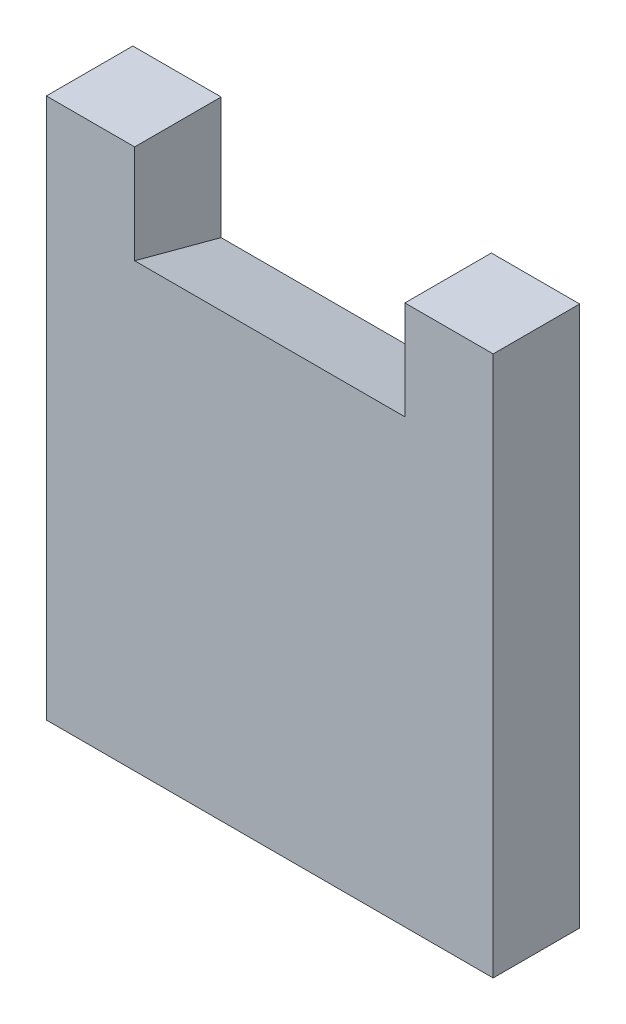
ISO-10303-21;
HEADER;
FILE_DESCRIPTION(('STEP AP214'),'2;1');
FILE_NAME('part.step','',(''),(''),'','','');
FILE_SCHEMA(('AUTOMOTIVE_DESIGN { 1 0 10303 214 1 1 1 1 }'));
ENDSEC;
DATA;
#1=APPLICATION_CONTEXT('core data for automotive mechanical design processes');
#2=APPLICATION_PROTOCOL_DEFINITION('international standard','automotive_design',2000,#1);
#3=PRODUCT_CONTEXT('',#1,'mechanical');
#4=PRODUCT('Part','Part','',(#3));
#5=PRODUCT_RELATED_PRODUCT_CATEGORY('part','',(#4));
#6=PRODUCT_DEFINITION_FORMATION('','',#4);
#7=PRODUCT_DEFINITION_CONTEXT('part definition',#1,'design');
#8=PRODUCT_DEFINITION('design','',#6,#7);
#9=PRODUCT_DEFINITION_SHAPE('','',#8);
#10=(LENGTH_UNIT() NAMED_UNIT(*) SI_UNIT(.MILLI.,.METRE.));
#11=(NAMED_UNIT(*) PLANE_ANGLE_UNIT() SI_UNIT($,.RADIAN.));
#12=(NAMED_UNIT(*) SI_UNIT($,.STERADIAN.) SOLID_ANGLE_UNIT());
#13=UNCERTAINTY_MEASURE_WITH_UNIT(LENGTH_MEASURE(1.E-05),#10,'distance_accuracy_value','');
#14=(GEOMETRIC_REPRESENTATION_CONTEXT(3) GLOBAL_UNCERTAINTY_ASSIGNED_CONTEXT((#13)) GLOBAL_UNIT_ASSIGNED_CONTEXT((#10,
#11,#12)) REPRESENTATION_CONTEXT('',''));
#15=CARTESIAN_POINT('',(0.,0.,0.));
#16=DIRECTION('',(0.,0.,1.));
#17=DIRECTION('',(1.,0.,0.));
#18=AXIS2_PLACEMENT_3D('',#15,#16,#17);
#19=CARTESIAN_POINT('',(0.,0.,9.6));
#20=DIRECTION('',(0.,1.,0.));
#21=DIRECTION('',(0.,0.,1.));
#22=AXIS2_PLACEMENT_3D('',#19,#20,#21);
#23=PLANE('',#22);
#24=DIRECTION('',(1.,0.,0.));
#25=VECTOR('',#24,1.);
#26=CARTESIAN_POINT('',(0.,0.,0.));
#27=LINE('',#26,#25);
#28=CARTESIAN_POINT('',(39.8,0.,0.));
#29=VERTEX_POINT('',#28);
#30=CARTESIAN_POINT('',(49.6,0.,0.));
#31=VERTEX_POINT('',#30);
#32=EDGE_CURVE('E114',#29,#31,#27,.T.);
#33=ORIENTED_EDGE('',*,*,#32,.F.);
#34=DIRECTION('',(0.,0.,-1.));
#35=VECTOR('',#34,1.);
#36=CARTESIAN_POINT('',(39.8,0.,9.6));
#37=LINE('',#36,#35);
#38=CARTESIAN_POINT('',(39.8,0.,9.6));
#39=VERTEX_POINT('',#38);
#40=EDGE_CURVE('E11',#39,#29,#37,.T.);
#41=ORIENTED_EDGE('',*,*,#40,.F.);
#42=DIRECTION('',(1.,0.,0.));
#43=VECTOR('',#42,1.);
#44=CARTESIAN_POINT('',(0.,0.,9.6));
#45=LINE('',#44,#43);
#46=CARTESIAN_POINT('',(49.6,0.,9.6));
#47=VERTEX_POINT('',#46);
#48=EDGE_CURVE('E124',#39,#47,#45,.T.);
#49=ORIENTED_EDGE('',*,*,#48,.T.);
#50=DIRECTION('',(0.,0.,-1.));
#51=VECTOR('',#50,1.);
#52=CARTESIAN_POINT('',(49.6,0.,9.6));
#53=LINE('',#52,#51);
#54=EDGE_CURVE('E55',#47,#31,#53,.T.);
#55=ORIENTED_EDGE('',*,*,#54,.T.);
#56=EDGE_LOOP('',(#33,#41,#49,#55));
#57=FACE_BOUND('',#56,.T.);
#58=ADVANCED_FACE('F36',(#57),#23,.T.);
#59=CARTESIAN_POINT('',(39.8,0.,9.6));
#60=DIRECTION('',(1.,0.,0.));
#61=DIRECTION('',(0.,0.,-1.));
#62=AXIS2_PLACEMENT_3D('',#59,#60,#61);
#63=PLANE('',#62);
#64=DIRECTION('',(0.,-1.,0.));
#65=VECTOR('',#64,1.);
#66=CARTESIAN_POINT('',(39.8,0.,0.));
#67=LINE('',#66,#65);
#68=CARTESIAN_POINT('',(39.8,-13.5223122473388,0.));
#69=VERTEX_POINT('',#68);
#70=EDGE_CURVE('E104',#29,#69,#67,.T.);
#71=ORIENTED_EDGE('',*,*,#70,.T.);
#72=DIRECTION('',(0.,-0.258819045102521,-0.965925826289068));
#73=VECTOR('',#72,1.);
#74=CARTESIAN_POINT('',(39.8,-10.95,9.6));
#75=LINE('',#74,#73);
#76=CARTESIAN_POINT('',(39.8,-10.95,9.6));
#77=VERTEX_POINT('',#76);
#78=EDGE_CURVE('E46',#77,#69,#75,.T.);
#79=ORIENTED_EDGE('',*,*,#78,.F.);
#80=DIRECTION('',(0.,-1.,0.));
#81=VECTOR('',#80,1.);
#82=CARTESIAN_POINT('',(39.8,0.,9.6));
#83=LINE('',#82,#81);
#84=EDGE_CURVE('E152',#39,#77,#83,.T.);
#85=ORIENTED_EDGE('',*,*,#84,.F.);
#86=ORIENTED_EDGE('',*,*,#40,.T.);
#87=EDGE_LOOP('',(#71,#79,#85,#86));
#88=FACE_BOUND('',#87,.T.);
#89=ADVANCED_FACE('F161',(#88),#63,.F.);
#90=CARTESIAN_POINT('',(0.,-10.95,9.6));
#91=DIRECTION('',(0.,0.965925826289068,-0.258819045102521));
#92=DIRECTION('',(0.,0.258819045102521,0.965925826289068));
#93=AXIS2_PLACEMENT_3D('',#90,#91,#92);
#94=PLANE('',#93);
#95=DIRECTION('',(1.,0.,0.));
#96=VECTOR('',#95,1.);
#97=CARTESIAN_POINT('',(0.,-13.5223122473388,0.));
#98=LINE('',#97,#96);
#99=CARTESIAN_POINT('',(9.8,-13.5223122473388,0.));
#100=VERTEX_POINT('',#99);
#101=EDGE_CURVE('E101',#100,#69,#98,.T.);
#102=ORIENTED_EDGE('',*,*,#101,.F.);
#103=DIRECTION('',(0.,-0.258819045102521,-0.965925826289068));
#104=VECTOR('',#103,1.);
#105=CARTESIAN_POINT('',(9.8,-10.95,9.6));
#106=LINE('',#105,#104);
#107=CARTESIAN_POINT('',(9.8,-10.95,9.6));
#108=VERTEX_POINT('',#107);
#109=EDGE_CURVE('E40',#108,#100,#106,.T.);
#110=ORIENTED_EDGE('',*,*,#109,.F.);
#111=DIRECTION('',(1.,0.,0.));
#112=VECTOR('',#111,1.);
#113=CARTESIAN_POINT('',(0.,-10.95,9.6));
#114=LINE('',#113,#112);
#115=EDGE_CURVE('E148',#108,#77,#114,.T.);
#116=ORIENTED_EDGE('',*,*,#115,.T.);
#117=ORIENTED_EDGE('',*,*,#78,.T.);
#118=EDGE_LOOP('',(#102,#110,#116,#117));
#119=FACE_BOUND('',#118,.T.);
#120=ADVANCED_FACE('F38',(#119),#94,.T.);
#121=CARTESIAN_POINT('',(9.8,0.,9.6));
#122=DIRECTION('',(1.,0.,0.));
#123=DIRECTION('',(0.,1.,0.));
#124=AXIS2_PLACEMENT_3D('',#121,#122,#123);
#125=PLANE('',#124);
#126=DIRECTION('',(0.,-1.,0.));
#127=VECTOR('',#126,1.);
#128=CARTESIAN_POINT('',(9.8,0.,0.));
#129=LINE('',#128,#127);
#130=CARTESIAN_POINT('',(9.8,0.,0.));
#131=VERTEX_POINT('',#130);
#132=EDGE_CURVE('E93',#131,#100,#129,.T.);
#133=ORIENTED_EDGE('',*,*,#132,.F.);
#134=DIRECTION('',(0.,0.,-1.));
#135=VECTOR('',#134,1.);
#136=CARTESIAN_POINT('',(9.8,0.,9.6));
#137=LINE('',#136,#135);
#138=CARTESIAN_POINT('',(9.8,0.,9.6));
#139=VERTEX_POINT('',#138);
#140=EDGE_CURVE('E99',#139,#131,#137,.T.);
#141=ORIENTED_EDGE('',*,*,#140,.F.);
#142=DIRECTION('',(0.,-1.,0.));
#143=VECTOR('',#142,1.);
#144=CARTESIAN_POINT('',(9.8,0.,9.6));
#145=LINE('',#144,#143);
#146=EDGE_CURVE('E97',#139,#108,#145,.T.);
#147=ORIENTED_EDGE('',*,*,#146,.T.);
#148=ORIENTED_EDGE('',*,*,#109,.T.);
#149=EDGE_LOOP('',(#133,#141,#147,#148));
#150=FACE_BOUND('',#149,.T.);
#151=ADVANCED_FACE('F90',(#150),#125,.T.);
#152=CARTESIAN_POINT('',(0.,0.,0.));
#153=VERTEX_POINT('',#152);
#154=EDGE_CURVE('E110',#153,#131,#27,.T.);
#155=ORIENTED_EDGE('',*,*,#154,.F.);
#156=DIRECTION('',(0.,0.,-1.));
#157=VECTOR('',#156,1.);
#158=CARTESIAN_POINT('',(0.,0.,9.6));
#159=LINE('',#158,#157);
#160=CARTESIAN_POINT('',(0.,0.,9.6));
#161=VERTEX_POINT('',#160);
#162=EDGE_CURVE('E132',#161,#153,#159,.T.);
#163=ORIENTED_EDGE('',*,*,#162,.F.);
#164=EDGE_CURVE('E140',#161,#139,#45,.T.);
#165=ORIENTED_EDGE('',*,*,#164,.T.);
#166=ORIENTED_EDGE('',*,*,#140,.T.);
#167=EDGE_LOOP('',(#155,#163,#165,#166));
#168=FACE_BOUND('',#167,.T.);
#169=ADVANCED_FACE('F136',(#168),#23,.T.);
#170=CARTESIAN_POINT('',(0.,0.,9.6));
#171=DIRECTION('',(1.,0.,0.));
#172=DIRECTION('',(0.,0.,-1.));
#173=AXIS2_PLACEMENT_3D('',#170,#171,#172);
#174=PLANE('',#173);
#175=DIRECTION('',(0.,-1.,0.));
#176=VECTOR('',#175,1.);
#177=CARTESIAN_POINT('',(0.,0.,0.));
#178=LINE('',#177,#176);
#179=CARTESIAN_POINT('',(0.,-60.,0.));
#180=VERTEX_POINT('',#179);
#181=EDGE_CURVE('E112',#153,#180,#178,.T.);
#182=ORIENTED_EDGE('',*,*,#181,.T.);
#183=DIRECTION('',(0.,0.,-1.));
#184=VECTOR('',#183,1.);
#185=CARTESIAN_POINT('',(0.,-60.,9.6));
#186=LINE('',#185,#184);
#187=CARTESIAN_POINT('',(0.,-60.,9.6));
#188=VERTEX_POINT('',#187);
#189=EDGE_CURVE('E129',#188,#180,#186,.T.);
#190=ORIENTED_EDGE('',*,*,#189,.F.);
#191=DIRECTION('',(0.,-1.,0.));
#192=VECTOR('',#191,1.);
#193=CARTESIAN_POINT('',(0.,0.,9.6));
#194=LINE('',#193,#192);
#195=EDGE_CURVE('E150',#161,#188,#194,.T.);
#196=ORIENTED_EDGE('',*,*,#195,.F.);
#197=ORIENTED_EDGE('',*,*,#162,.T.);
#198=EDGE_LOOP('',(#182,#190,#196,#197));
#199=FACE_BOUND('',#198,.T.);
#200=ADVANCED_FACE('F175',(#199),#174,.F.);
#201=CARTESIAN_POINT('',(0.,-60.,9.6));
#202=DIRECTION('',(0.,1.,0.));
#203=DIRECTION('',(0.,0.,1.));
#204=AXIS2_PLACEMENT_3D('',#201,#202,#203);
#205=PLANE('',#204);
#206=DIRECTION('',(1.,0.,0.));
#207=VECTOR('',#206,1.);
#208=CARTESIAN_POINT('',(0.,-60.,0.));
#209=LINE('',#208,#207);
#210=CARTESIAN_POINT('',(49.6,-60.,0.));
#211=VERTEX_POINT('',#210);
#212=EDGE_CURVE('E118',#180,#211,#209,.T.);
#213=ORIENTED_EDGE('',*,*,#212,.T.);
#214=DIRECTION('',(0.,0.,-1.));
#215=VECTOR('',#214,1.);
#216=CARTESIAN_POINT('',(49.6,-60.,9.6));
#217=LINE('',#216,#215);
#218=CARTESIAN_POINT('',(49.6,-60.,9.6));
#219=VERTEX_POINT('',#218);
#220=EDGE_CURVE('E126',#219,#211,#217,.T.);
#221=ORIENTED_EDGE('',*,*,#220,.F.);
#222=DIRECTION('',(1.,0.,0.));
#223=VECTOR('',#222,1.);
#224=CARTESIAN_POINT('',(0.,-60.,9.6));
#225=LINE('',#224,#223);
#226=EDGE_CURVE('E157',#188,#219,#225,.T.);
#227=ORIENTED_EDGE('',*,*,#226,.F.);
#228=ORIENTED_EDGE('',*,*,#189,.T.);
#229=EDGE_LOOP('',(#213,#221,#227,#228));
#230=FACE_BOUND('',#229,.T.);
#231=ADVANCED_FACE('F172',(#230),#205,.F.);
#232=CARTESIAN_POINT('',(49.6,0.,9.6));
#233=DIRECTION('',(1.,0.,0.));
#234=DIRECTION('',(0.,1.,0.));
#235=AXIS2_PLACEMENT_3D('',#232,#233,#234);
#236=PLANE('',#235);
#237=DIRECTION('',(0.,-1.,0.));
#238=VECTOR('',#237,1.);
#239=CARTESIAN_POINT('',(49.6,0.,0.));
#240=LINE('',#239,#238);
#241=EDGE_CURVE('E121',#31,#211,#240,.T.);
#242=ORIENTED_EDGE('',*,*,#241,.F.);
#243=ORIENTED_EDGE('',*,*,#54,.F.);
#244=DIRECTION('',(0.,-1.,0.));
#245=VECTOR('',#244,1.);
#246=CARTESIAN_POINT('',(49.6,0.,9.6));
#247=LINE('',#246,#245);
#248=EDGE_CURVE('E127',#47,#219,#247,.T.);
#249=ORIENTED_EDGE('',*,*,#248,.T.);
#250=ORIENTED_EDGE('',*,*,#220,.T.);
#251=EDGE_LOOP('',(#242,#243,#249,#250));
#252=FACE_BOUND('',#251,.T.);
#253=ADVANCED_FACE('F169',(#252),#236,.T.);
#254=CARTESIAN_POINT('',(0.,0.,9.6));
#255=DIRECTION('',(0.,0.,1.));
#256=DIRECTION('',(1.,0.,0.));
#257=AXIS2_PLACEMENT_3D('',#254,#255,#256);
#258=PLANE('',#257);
#259=ORIENTED_EDGE('',*,*,#48,.F.);
#260=ORIENTED_EDGE('',*,*,#84,.T.);
#261=ORIENTED_EDGE('',*,*,#115,.F.);
#262=ORIENTED_EDGE('',*,*,#146,.F.);
#263=ORIENTED_EDGE('',*,*,#164,.F.);
#264=ORIENTED_EDGE('',*,*,#195,.T.);
#265=ORIENTED_EDGE('',*,*,#226,.T.);
#266=ORIENTED_EDGE('',*,*,#248,.F.);
#267=EDGE_LOOP('',(#259,#260,#261,#262,#263,#264,#265,#266));
#268=FACE_BOUND('',#267,.T.);
#269=ADVANCED_FACE('F145',(#268),#258,.T.);
#270=CARTESIAN_POINT('',(0.,0.,0.));
#271=DIRECTION('',(0.,0.,1.));
#272=DIRECTION('',(1.,0.,0.));
#273=AXIS2_PLACEMENT_3D('',#270,#271,#272);
#274=PLANE('',#273);
#275=ORIENTED_EDGE('',*,*,#32,.T.);
#276=ORIENTED_EDGE('',*,*,#241,.T.);
#277=ORIENTED_EDGE('',*,*,#212,.F.);
#278=ORIENTED_EDGE('',*,*,#181,.F.);
#279=ORIENTED_EDGE('',*,*,#154,.T.);
#280=ORIENTED_EDGE('',*,*,#132,.T.);
#281=ORIENTED_EDGE('',*,*,#101,.T.);
#282=ORIENTED_EDGE('',*,*,#70,.F.);
#283=EDGE_LOOP('',(#275,#276,#277,#278,#279,#280,#281,#282));
#284=FACE_BOUND('',#283,.T.);
#285=ADVANCED_FACE('F107',(#284),#274,.F.);
#286=CLOSED_SHELL('',(#58,#89,#120,#151,#169,#200,#231,#253,#269,#285));
#287=MANIFOLD_SOLID_BREP('B2',#286);
#288=ADVANCED_BREP_SHAPE_REPRESENTATION('',(#18,#287),#14);
#289=SHAPE_DEFINITION_REPRESENTATION(#9,#288);
ENDSEC;
END-ISO-10303-21;
